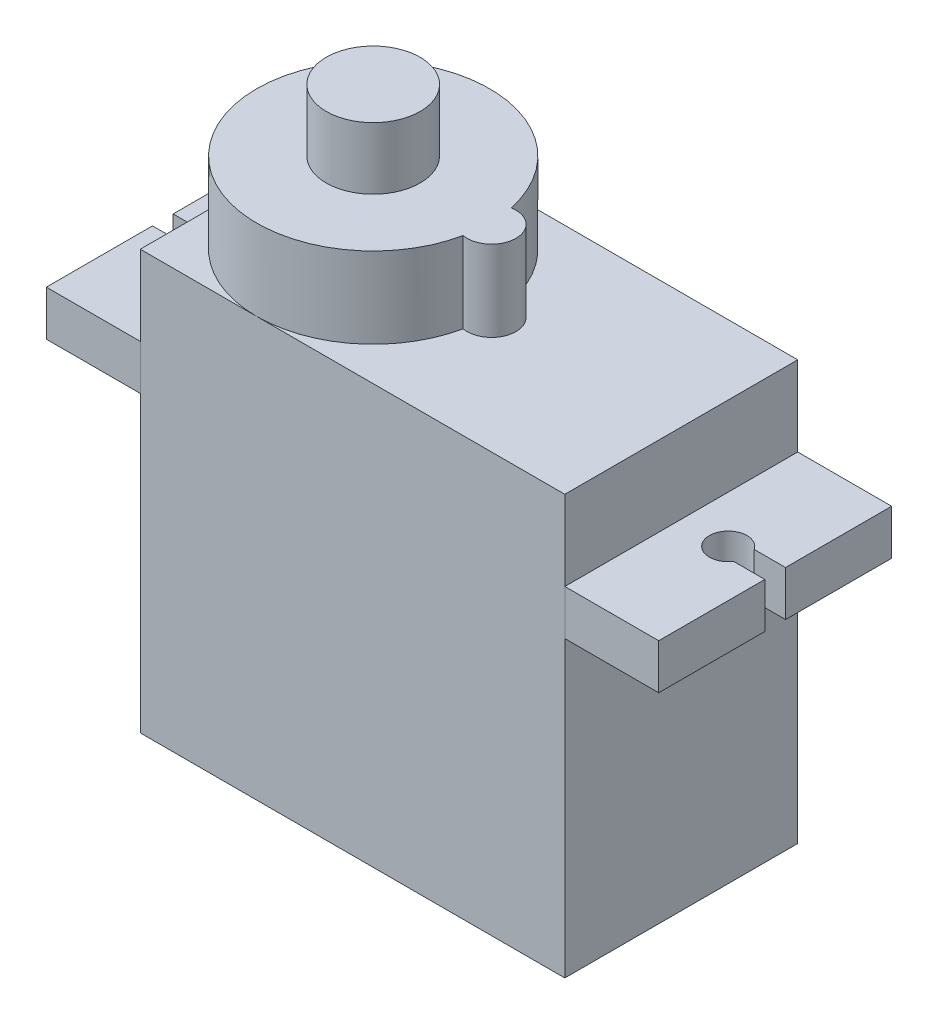
ISO-10303-21;
HEADER;
FILE_DESCRIPTION(('STEP AP214'),'2;1');
FILE_NAME('part.step','',(''),(''),'','','');
FILE_SCHEMA(('AUTOMOTIVE_DESIGN { 1 0 10303 214 1 1 1 1 }'));
ENDSEC;
DATA;
#1=APPLICATION_CONTEXT('core data for automotive mechanical design processes');
#2=APPLICATION_PROTOCOL_DEFINITION('international standard','automotive_design',2000,#1);
#3=PRODUCT_CONTEXT('',#1,'mechanical');
#4=PRODUCT('Part','Part','',(#3));
#5=PRODUCT_RELATED_PRODUCT_CATEGORY('part','',(#4));
#6=PRODUCT_DEFINITION_FORMATION('','',#4);
#7=PRODUCT_DEFINITION_CONTEXT('part definition',#1,'design');
#8=PRODUCT_DEFINITION('design','',#6,#7);
#9=PRODUCT_DEFINITION_SHAPE('','',#8);
#10=(LENGTH_UNIT() NAMED_UNIT(*) SI_UNIT(.MILLI.,.METRE.));
#11=(NAMED_UNIT(*) PLANE_ANGLE_UNIT() SI_UNIT($,.RADIAN.));
#12=(NAMED_UNIT(*) SI_UNIT($,.STERADIAN.) SOLID_ANGLE_UNIT());
#13=UNCERTAINTY_MEASURE_WITH_UNIT(LENGTH_MEASURE(1.E-05),#10,'distance_accuracy_value','');
#14=(GEOMETRIC_REPRESENTATION_CONTEXT(3) GLOBAL_UNCERTAINTY_ASSIGNED_CONTEXT((#13)) GLOBAL_UNIT_ASSIGNED_CONTEXT((#10,
#11,#12)) REPRESENTATION_CONTEXT('',''));
#15=CARTESIAN_POINT('',(0.,0.,0.));
#16=DIRECTION('',(0.,0.,1.));
#17=DIRECTION('',(1.,0.,0.));
#18=AXIS2_PLACEMENT_3D('',#15,#16,#17);
#19=CARTESIAN_POINT('',(-13.6,4.5,1.2));
#20=DIRECTION('',(1.,0.,0.));
#21=DIRECTION('',(0.,0.,-1.));
#22=AXIS2_PLACEMENT_3D('',#19,#20,#21);
#23=CYLINDRICAL_SURFACE('',#22,0.6);
#24=CARTESIAN_POINT('',(-13.6,4.5,1.2));
#25=DIRECTION('',(-1.,0.,0.));
#26=DIRECTION('',(0.,0.,1.));
#27=AXIS2_PLACEMENT_3D('',#24,#25,#26);
#28=CIRCLE('',#27,0.6);
#29=CARTESIAN_POINT('',(-13.6,4.5,1.8));
#30=VERTEX_POINT('',#29);
#31=EDGE_CURVE('E12',#30,#30,#28,.T.);
#32=ORIENTED_EDGE('',*,*,#31,.F.);
#33=EDGE_LOOP('',(#32));
#34=FACE_BOUND('',#33,.T.);
#35=CARTESIAN_POINT('',(-11.3,4.5,1.2));
#36=DIRECTION('',(-1.,0.,0.));
#37=DIRECTION('',(0.,0.,1.));
#38=AXIS2_PLACEMENT_3D('',#35,#36,#37);
#39=CIRCLE('',#38,0.6);
#40=CARTESIAN_POINT('',(-11.3,4.5,1.8));
#41=VERTEX_POINT('',#40);
#42=EDGE_CURVE('E50',#41,#41,#39,.T.);
#43=ORIENTED_EDGE('',*,*,#42,.T.);
#44=EDGE_LOOP('',(#43));
#45=FACE_BOUND('',#44,.T.);
#46=ADVANCED_FACE('F47',(#34,#45),#23,.T.);
#47=CARTESIAN_POINT('',(-13.6,0.,0.));
#48=DIRECTION('',(-1.,0.,0.));
#49=DIRECTION('',(0.,0.,1.));
#50=AXIS2_PLACEMENT_3D('',#47,#48,#49);
#51=PLANE('',#50);
#52=ORIENTED_EDGE('',*,*,#31,.T.);
#53=EDGE_LOOP('',(#52));
#54=FACE_BOUND('',#53,.T.);
#55=ADVANCED_FACE('F62',(#54),#51,.T.);
#56=CARTESIAN_POINT('',(-11.3,0.,0.));
#57=DIRECTION('',(-1.,0.,0.));
#58=DIRECTION('',(0.,0.,1.));
#59=AXIS2_PLACEMENT_3D('',#56,#57,#58);
#60=PLANE('',#59);
#61=ORIENTED_EDGE('',*,*,#42,.F.);
#62=EDGE_LOOP('',(#61));
#63=FACE_BOUND('',#62,.T.);
#64=ADVANCED_FACE('F60',(#63),#60,.F.);
#65=CLOSED_SHELL('',(#46,#55,#64));
#66=MANIFOLD_SOLID_BREP('B2',#65);
#67=CARTESIAN_POINT('',(-13.6,4.5,-1.2));
#68=DIRECTION('',(1.,0.,0.));
#69=DIRECTION('',(0.,0.,-1.));
#70=AXIS2_PLACEMENT_3D('',#67,#68,#69);
#71=CYLINDRICAL_SURFACE('',#70,0.6);
#72=CARTESIAN_POINT('',(-13.6,4.5,-1.2));
#73=DIRECTION('',(-1.,0.,0.));
#74=DIRECTION('',(0.,0.,1.));
#75=AXIS2_PLACEMENT_3D('',#72,#73,#74);
#76=CIRCLE('',#75,0.6);
#77=CARTESIAN_POINT('',(-13.6,4.5,-0.600000000000001));
#78=VERTEX_POINT('',#77);
#79=EDGE_CURVE('E46',#78,#78,#76,.T.);
#80=ORIENTED_EDGE('',*,*,#79,.F.);
#81=EDGE_LOOP('',(#80));
#82=FACE_BOUND('',#81,.T.);
#83=CARTESIAN_POINT('',(-11.3,4.5,-1.2));
#84=DIRECTION('',(-1.,0.,0.));
#85=DIRECTION('',(0.,0.,1.));
#86=AXIS2_PLACEMENT_3D('',#83,#84,#85);
#87=CIRCLE('',#86,0.6);
#88=CARTESIAN_POINT('',(-11.3,4.5,-0.600000000000001));
#89=VERTEX_POINT('',#88);
#90=EDGE_CURVE('E102',#89,#89,#87,.T.);
#91=ORIENTED_EDGE('',*,*,#90,.T.);
#92=EDGE_LOOP('',(#91));
#93=FACE_BOUND('',#92,.T.);
#94=ADVANCED_FACE('F99',(#82,#93),#71,.T.);
#95=CARTESIAN_POINT('',(-13.6,0.,0.));
#96=DIRECTION('',(-1.,0.,0.));
#97=DIRECTION('',(0.,0.,1.));
#98=AXIS2_PLACEMENT_3D('',#95,#96,#97);
#99=PLANE('',#98);
#100=ORIENTED_EDGE('',*,*,#79,.T.);
#101=EDGE_LOOP('',(#100));
#102=FACE_BOUND('',#101,.T.);
#103=ADVANCED_FACE('F114',(#102),#99,.T.);
#104=CARTESIAN_POINT('',(-11.3,0.,0.));
#105=DIRECTION('',(-1.,0.,0.));
#106=DIRECTION('',(0.,0.,1.));
#107=AXIS2_PLACEMENT_3D('',#104,#105,#106);
#108=PLANE('',#107);
#109=ORIENTED_EDGE('',*,*,#90,.F.);
#110=EDGE_LOOP('',(#109));
#111=FACE_BOUND('',#110,.T.);
#112=ADVANCED_FACE('F112',(#111),#108,.F.);
#113=CLOSED_SHELL('',(#94,#103,#112));
#114=MANIFOLD_SOLID_BREP('B7',#113);
#115=CARTESIAN_POINT('',(-13.6,4.5,0.));
#116=DIRECTION('',(1.,0.,0.));
#117=DIRECTION('',(0.,0.,-1.));
#118=AXIS2_PLACEMENT_3D('',#115,#116,#117);
#119=CYLINDRICAL_SURFACE('',#118,0.6);
#120=CARTESIAN_POINT('',(-13.6,4.5,0.));
#121=DIRECTION('',(-1.,0.,0.));
#122=DIRECTION('',(0.,0.,1.));
#123=AXIS2_PLACEMENT_3D('',#120,#121,#122);
#124=CIRCLE('',#123,0.6);
#125=CARTESIAN_POINT('',(-13.6,4.5,0.599999999999999));
#126=VERTEX_POINT('',#125);
#127=EDGE_CURVE('E98',#126,#126,#124,.T.);
#128=ORIENTED_EDGE('',*,*,#127,.F.);
#129=EDGE_LOOP('',(#128));
#130=FACE_BOUND('',#129,.T.);
#131=CARTESIAN_POINT('',(-11.3,4.5,0.));
#132=DIRECTION('',(-1.,0.,0.));
#133=DIRECTION('',(0.,0.,1.));
#134=AXIS2_PLACEMENT_3D('',#131,#132,#133);
#135=CIRCLE('',#134,0.6);
#136=CARTESIAN_POINT('',(-11.3,4.5,0.599999999999999));
#137=VERTEX_POINT('',#136);
#138=EDGE_CURVE('E156',#137,#137,#135,.T.);
#139=ORIENTED_EDGE('',*,*,#138,.T.);
#140=EDGE_LOOP('',(#139));
#141=FACE_BOUND('',#140,.T.);
#142=ADVANCED_FACE('F153',(#130,#141),#119,.T.);
#143=CARTESIAN_POINT('',(-13.6,0.,0.));
#144=DIRECTION('',(-1.,0.,0.));
#145=DIRECTION('',(0.,0.,1.));
#146=AXIS2_PLACEMENT_3D('',#143,#144,#145);
#147=PLANE('',#146);
#148=ORIENTED_EDGE('',*,*,#127,.T.);
#149=EDGE_LOOP('',(#148));
#150=FACE_BOUND('',#149,.T.);
#151=ADVANCED_FACE('F168',(#150),#147,.T.);
#152=CARTESIAN_POINT('',(-11.3,0.,0.));
#153=DIRECTION('',(-1.,0.,0.));
#154=DIRECTION('',(0.,0.,1.));
#155=AXIS2_PLACEMENT_3D('',#152,#153,#154);
#156=PLANE('',#155);
#157=ORIENTED_EDGE('',*,*,#138,.F.);
#158=EDGE_LOOP('',(#157));
#159=FACE_BOUND('',#158,.T.);
#160=ADVANCED_FACE('F166',(#159),#156,.F.);
#161=CLOSED_SHELL('',(#142,#151,#160));
#162=MANIFOLD_SOLID_BREP('B41',#161);
#163=CARTESIAN_POINT('',(-16.3,0.,0.));
#164=DIRECTION('',(-1.,0.,0.));
#165=DIRECTION('',(0.,0.,1.));
#166=AXIS2_PLACEMENT_3D('',#163,#164,#165);
#167=PLANE('',#166);
#168=DIRECTION('',(0.,1.,0.));
#169=VECTOR('',#168,1.);
#170=CARTESIAN_POINT('',(-16.3,-0.001000000000001,-0.55));
#171=LINE('',#170,#169);
#172=CARTESIAN_POINT('',(-16.3,15.65,-0.55));
#173=VERTEX_POINT('',#172);
#174=CARTESIAN_POINT('',(-16.3,18.05,-0.55));
#175=VERTEX_POINT('',#174);
#176=EDGE_CURVE('E337',#173,#175,#171,.T.);
#177=ORIENTED_EDGE('',*,*,#176,.T.);
#178=DIRECTION('',(0.,0.,-1.));
#179=VECTOR('',#178,1.);
#180=CARTESIAN_POINT('',(-16.3,18.05,6.2));
#181=LINE('',#180,#179);
#182=CARTESIAN_POINT('',(-16.3,18.05,-6.2));
#183=VERTEX_POINT('',#182);
#184=EDGE_CURVE('E260',#175,#183,#181,.T.);
#185=ORIENTED_EDGE('',*,*,#184,.T.);
#186=DIRECTION('',(0.,-1.,0.));
#187=VECTOR('',#186,1.);
#188=CARTESIAN_POINT('',(-16.3,18.05,-6.2));
#189=LINE('',#188,#187);
#190=CARTESIAN_POINT('',(-16.3,15.65,-6.2));
#191=VERTEX_POINT('',#190);
#192=EDGE_CURVE('E299',#183,#191,#189,.T.);
#193=ORIENTED_EDGE('',*,*,#192,.T.);
#194=DIRECTION('',(0.,0.,1.));
#195=VECTOR('',#194,1.);
#196=CARTESIAN_POINT('',(-16.3,15.65,-6.2));
#197=LINE('',#196,#195);
#198=EDGE_CURVE('E305',#191,#173,#197,.T.);
#199=ORIENTED_EDGE('',*,*,#198,.T.);
#200=EDGE_LOOP('',(#177,#185,#193,#199));
#201=FACE_BOUND('',#200,.T.);
#202=ADVANCED_FACE('F207',(#201),#167,.T.);
#203=CARTESIAN_POINT('',(-16.3,18.05,6.2));
#204=DIRECTION('',(0.,-1.,0.));
#205=DIRECTION('',(0.,0.,-1.));
#206=AXIS2_PLACEMENT_3D('',#203,#204,#205);
#207=PLANE('',#206);
#208=ORIENTED_EDGE('',*,*,#184,.F.);
#209=DIRECTION('',(-1.,0.,0.));
#210=VECTOR('',#209,1.);
#211=CARTESIAN_POINT('',(-16.3,18.05,-0.55));
#212=LINE('',#211,#210);
#213=CARTESIAN_POINT('',(-14.6351646544245,18.05,-0.55));
#214=VERTEX_POINT('',#213);
#215=EDGE_CURVE('E288',#214,#175,#212,.T.);
#216=ORIENTED_EDGE('',*,*,#215,.F.);
#217=CARTESIAN_POINT('',(-13.8,18.05,0.));
#218=DIRECTION('',(0.,1.,0.));
#219=DIRECTION('',(0.,0.,1.));
#220=AXIS2_PLACEMENT_3D('',#217,#218,#219);
#221=CIRCLE('',#220,1.);
#222=CARTESIAN_POINT('',(-14.6351646544245,18.05,0.55));
#223=VERTEX_POINT('',#222);
#224=EDGE_CURVE('E295',#223,#214,#221,.T.);
#225=ORIENTED_EDGE('',*,*,#224,.F.);
#226=DIRECTION('',(1.,0.,0.));
#227=VECTOR('',#226,1.);
#228=CARTESIAN_POINT('',(-16.3,18.05,0.55));
#229=LINE('',#228,#227);
#230=CARTESIAN_POINT('',(-16.3,18.05,0.55));
#231=VERTEX_POINT('',#230);
#232=EDGE_CURVE('E284',#231,#223,#229,.T.);
#233=ORIENTED_EDGE('',*,*,#232,.F.);
#234=CARTESIAN_POINT('',(-16.3,18.05,6.2));
#235=VERTEX_POINT('',#234);
#236=EDGE_CURVE('E292',#235,#231,#181,.T.);
#237=ORIENTED_EDGE('',*,*,#236,.F.);
#238=DIRECTION('',(1.,0.,0.));
#239=VECTOR('',#238,1.);
#240=CARTESIAN_POINT('',(-16.3,18.05,6.2));
#241=LINE('',#240,#239);
#242=CARTESIAN_POINT('',(-11.3,18.05,6.2));
#243=VERTEX_POINT('',#242);
#244=EDGE_CURVE('E309',#235,#243,#241,.T.);
#245=ORIENTED_EDGE('',*,*,#244,.T.);
#246=DIRECTION('',(0.,0.,-1.));
#247=VECTOR('',#246,1.);
#248=CARTESIAN_POINT('',(-11.3,18.05,6.2));
#249=LINE('',#248,#247);
#250=CARTESIAN_POINT('',(-11.3,18.05,-6.2));
#251=VERTEX_POINT('',#250);
#252=EDGE_CURVE('E310',#243,#251,#249,.T.);
#253=ORIENTED_EDGE('',*,*,#252,.T.);
#254=DIRECTION('',(1.,0.,0.));
#255=VECTOR('',#254,1.);
#256=CARTESIAN_POINT('',(-16.3,18.05,-6.2));
#257=LINE('',#256,#255);
#258=EDGE_CURVE('E151',#183,#251,#257,.T.);
#259=ORIENTED_EDGE('',*,*,#258,.F.);
#260=EDGE_LOOP('',(#208,#216,#225,#233,#237,#245,#253,#259));
#261=FACE_BOUND('',#260,.T.);
#262=ADVANCED_FACE('F209',(#261),#207,.F.);
#263=CARTESIAN_POINT('',(-16.3,18.05,-6.2));
#264=DIRECTION('',(0.,0.,1.));
#265=DIRECTION('',(1.,0.,0.));
#266=AXIS2_PLACEMENT_3D('',#263,#264,#265);
#267=PLANE('',#266);
#268=DIRECTION('',(0.,-1.,0.));
#269=VECTOR('',#268,1.);
#270=CARTESIAN_POINT('',(-11.3,18.05,-6.2));
#271=LINE('',#270,#269);
#272=CARTESIAN_POINT('',(-11.3,15.65,-6.2));
#273=VERTEX_POINT('',#272);
#274=EDGE_CURVE('E313',#251,#273,#271,.T.);
#275=ORIENTED_EDGE('',*,*,#274,.T.);
#276=DIRECTION('',(1.,0.,0.));
#277=VECTOR('',#276,1.);
#278=CARTESIAN_POINT('',(-16.3,15.65,-6.2));
#279=LINE('',#278,#277);
#280=EDGE_CURVE('E215',#191,#273,#279,.T.);
#281=ORIENTED_EDGE('',*,*,#280,.F.);
#282=ORIENTED_EDGE('',*,*,#192,.F.);
#283=ORIENTED_EDGE('',*,*,#258,.T.);
#284=EDGE_LOOP('',(#275,#281,#282,#283));
#285=FACE_BOUND('',#284,.T.);
#286=ADVANCED_FACE('F351',(#285),#267,.F.);
#287=CARTESIAN_POINT('',(-16.3,15.65,-6.2));
#288=DIRECTION('',(0.,1.,0.));
#289=DIRECTION('',(0.,0.,1.));
#290=AXIS2_PLACEMENT_3D('',#287,#288,#289);
#291=PLANE('',#290);
#292=CARTESIAN_POINT('',(-13.8,15.65,0.));
#293=DIRECTION('',(0.,1.,0.));
#294=DIRECTION('',(0.,0.,1.));
#295=AXIS2_PLACEMENT_3D('',#292,#293,#294);
#296=CIRCLE('',#295,1.);
#297=CARTESIAN_POINT('',(-14.6351646544245,15.65,-0.55));
#298=VERTEX_POINT('',#297);
#299=CARTESIAN_POINT('',(-14.6351646544245,15.65,0.55));
#300=VERTEX_POINT('',#299);
#301=EDGE_CURVE('E336',#298,#300,#296,.F.);
#302=ORIENTED_EDGE('',*,*,#301,.F.);
#303=DIRECTION('',(1.,0.,0.));
#304=VECTOR('',#303,1.);
#305=CARTESIAN_POINT('',(-16.3,15.65,-0.55));
#306=LINE('',#305,#304);
#307=EDGE_CURVE('E296',#173,#298,#306,.T.);
#308=ORIENTED_EDGE('',*,*,#307,.F.);
#309=ORIENTED_EDGE('',*,*,#198,.F.);
#310=ORIENTED_EDGE('',*,*,#280,.T.);
#311=DIRECTION('',(0.,0.,1.));
#312=VECTOR('',#311,1.);
#313=CARTESIAN_POINT('',(-11.3,15.65,-6.2));
#314=LINE('',#313,#312);
#315=CARTESIAN_POINT('',(-11.3,15.65,6.2));
#316=VERTEX_POINT('',#315);
#317=EDGE_CURVE('E315',#273,#316,#314,.T.);
#318=ORIENTED_EDGE('',*,*,#317,.T.);
#319=DIRECTION('',(1.,0.,0.));
#320=VECTOR('',#319,1.);
#321=CARTESIAN_POINT('',(-16.3,15.65,6.2));
#322=LINE('',#321,#320);
#323=CARTESIAN_POINT('',(-16.3,15.65,6.2));
#324=VERTEX_POINT('',#323);
#325=EDGE_CURVE('E319',#324,#316,#322,.T.);
#326=ORIENTED_EDGE('',*,*,#325,.F.);
#327=CARTESIAN_POINT('',(-16.3,15.65,0.549999999999997));
#328=VERTEX_POINT('',#327);
#329=EDGE_CURVE('E301',#328,#324,#197,.T.);
#330=ORIENTED_EDGE('',*,*,#329,.F.);
#331=DIRECTION('',(-1.,0.,0.));
#332=VECTOR('',#331,1.);
#333=CARTESIAN_POINT('',(-16.3,15.65,0.55));
#334=LINE('',#333,#332);
#335=EDGE_CURVE('E222',#300,#328,#334,.T.);
#336=ORIENTED_EDGE('',*,*,#335,.F.);
#337=EDGE_LOOP('',(#302,#308,#309,#310,#318,#326,#330,#336));
#338=FACE_BOUND('',#337,.T.);
#339=ADVANCED_FACE('F326',(#338),#291,.F.);
#340=CARTESIAN_POINT('',(-16.3,15.65,6.2));
#341=DIRECTION('',(0.,0.,-1.));
#342=DIRECTION('',(-1.,0.,0.));
#343=AXIS2_PLACEMENT_3D('',#340,#341,#342);
#344=PLANE('',#343);
#345=DIRECTION('',(0.,1.,0.));
#346=VECTOR('',#345,1.);
#347=CARTESIAN_POINT('',(-11.3,15.65,6.2));
#348=LINE('',#347,#346);
#349=EDGE_CURVE('E252',#316,#243,#348,.T.);
#350=ORIENTED_EDGE('',*,*,#349,.T.);
#351=ORIENTED_EDGE('',*,*,#244,.F.);
#352=DIRECTION('',(0.,1.,0.));
#353=VECTOR('',#352,1.);
#354=CARTESIAN_POINT('',(-16.3,15.65,6.2));
#355=LINE('',#354,#353);
#356=EDGE_CURVE('E231',#324,#235,#355,.T.);
#357=ORIENTED_EDGE('',*,*,#356,.F.);
#358=ORIENTED_EDGE('',*,*,#325,.T.);
#359=EDGE_LOOP('',(#350,#351,#357,#358));
#360=FACE_BOUND('',#359,.T.);
#361=ADVANCED_FACE('F334',(#360),#344,.F.);
#362=DIRECTION('',(0.,1.,0.));
#363=VECTOR('',#362,1.);
#364=CARTESIAN_POINT('',(-16.3,-0.001000000000001,0.55));
#365=LINE('',#364,#363);
#366=EDGE_CURVE('E281',#328,#231,#365,.T.);
#367=ORIENTED_EDGE('',*,*,#366,.F.);
#368=ORIENTED_EDGE('',*,*,#329,.T.);
#369=ORIENTED_EDGE('',*,*,#356,.T.);
#370=ORIENTED_EDGE('',*,*,#236,.T.);
#371=EDGE_LOOP('',(#367,#368,#369,#370));
#372=FACE_BOUND('',#371,.T.);
#373=ADVANCED_FACE('F298',(#372),#167,.T.);
#374=CARTESIAN_POINT('',(-11.3,0.,0.));
#375=DIRECTION('',(-1.,0.,0.));
#376=DIRECTION('',(0.,0.,1.));
#377=AXIS2_PLACEMENT_3D('',#374,#375,#376);
#378=PLANE('',#377);
#379=ORIENTED_EDGE('',*,*,#252,.F.);
#380=ORIENTED_EDGE('',*,*,#349,.F.);
#381=ORIENTED_EDGE('',*,*,#317,.F.);
#382=ORIENTED_EDGE('',*,*,#274,.F.);
#383=EDGE_LOOP('',(#379,#380,#381,#382));
#384=FACE_BOUND('',#383,.T.);
#385=ADVANCED_FACE('F332',(#384),#378,.F.);
#386=CARTESIAN_POINT('',(-16.3,-0.001000000000001,-0.55));
#387=DIRECTION('',(0.,0.,-1.));
#388=DIRECTION('',(-1.,0.,0.));
#389=AXIS2_PLACEMENT_3D('',#386,#387,#388);
#390=PLANE('',#389);
#391=ORIENTED_EDGE('',*,*,#307,.T.);
#392=DIRECTION('',(0.,1.,0.));
#393=VECTOR('',#392,1.);
#394=CARTESIAN_POINT('',(-14.6351646544245,-0.001000000000001,-0.55));
#395=LINE('',#394,#393);
#396=EDGE_CURVE('E338',#298,#214,#395,.T.);
#397=ORIENTED_EDGE('',*,*,#396,.T.);
#398=ORIENTED_EDGE('',*,*,#215,.T.);
#399=ORIENTED_EDGE('',*,*,#176,.F.);
#400=EDGE_LOOP('',(#391,#397,#398,#399));
#401=FACE_BOUND('',#400,.T.);
#402=ADVANCED_FACE('F350',(#401),#390,.F.);
#403=CARTESIAN_POINT('',(-13.8,-0.001000000000001,0.));
#404=DIRECTION('',(0.,1.,0.));
#405=DIRECTION('',(0.,0.,1.));
#406=AXIS2_PLACEMENT_3D('',#403,#404,#405);
#407=CYLINDRICAL_SURFACE('',#406,1.);
#408=ORIENTED_EDGE('',*,*,#301,.T.);
#409=DIRECTION('',(0.,1.,0.));
#410=VECTOR('',#409,1.);
#411=CARTESIAN_POINT('',(-14.6351646544245,-0.001000000000001,0.55));
#412=LINE('',#411,#410);
#413=EDGE_CURVE('E287',#300,#223,#412,.T.);
#414=ORIENTED_EDGE('',*,*,#413,.T.);
#415=ORIENTED_EDGE('',*,*,#224,.T.);
#416=ORIENTED_EDGE('',*,*,#396,.F.);
#417=EDGE_LOOP('',(#408,#414,#415,#416));
#418=FACE_BOUND('',#417,.T.);
#419=ADVANCED_FACE('F345',(#418),#407,.F.);
#420=CARTESIAN_POINT('',(-16.3,-0.001000000000001,0.55));
#421=DIRECTION('',(0.,0.,1.));
#422=DIRECTION('',(1.,0.,0.));
#423=AXIS2_PLACEMENT_3D('',#420,#421,#422);
#424=PLANE('',#423);
#425=ORIENTED_EDGE('',*,*,#335,.T.);
#426=ORIENTED_EDGE('',*,*,#366,.T.);
#427=ORIENTED_EDGE('',*,*,#232,.T.);
#428=ORIENTED_EDGE('',*,*,#413,.F.);
#429=EDGE_LOOP('',(#425,#426,#427,#428));
#430=FACE_BOUND('',#429,.T.);
#431=ADVANCED_FACE('F283',(#430),#424,.F.);
#432=CLOSED_SHELL('',(#202,#262,#286,#339,#361,#373,#385,#402,#419,#431));
#433=MANIFOLD_SOLID_BREP('B93',#432);
#434=CARTESIAN_POINT('',(16.3,15.65,6.2));
#435=DIRECTION('',(0.,1.,0.));
#436=DIRECTION('',(0.,0.,1.));
#437=AXIS2_PLACEMENT_3D('',#434,#435,#436);
#438=PLANE('',#437);
#439=DIRECTION('',(-1.,0.,0.));
#440=VECTOR('',#439,1.);
#441=CARTESIAN_POINT('',(14.6351646544245,15.65,-0.55));
#442=LINE('',#441,#440);
#443=CARTESIAN_POINT('',(16.3,15.65,-0.55));
#444=VERTEX_POINT('',#443);
#445=CARTESIAN_POINT('',(14.6351646544245,15.65,-0.55));
#446=VERTEX_POINT('',#445);
#447=EDGE_CURVE('E532',#444,#446,#442,.T.);
#448=ORIENTED_EDGE('',*,*,#447,.T.);
#449=CARTESIAN_POINT('',(13.8,15.65,0.));
#450=DIRECTION('',(0.,1.,0.));
#451=DIRECTION('',(0.,0.,1.));
#452=AXIS2_PLACEMENT_3D('',#449,#450,#451);
#453=CIRCLE('',#452,1.);
#454=CARTESIAN_POINT('',(14.6351646544245,15.65,0.55));
#455=VERTEX_POINT('',#454);
#456=EDGE_CURVE('E519',#455,#446,#453,.F.);
#457=ORIENTED_EDGE('',*,*,#456,.F.);
#458=DIRECTION('',(-1.,0.,0.));
#459=VECTOR('',#458,1.);
#460=CARTESIAN_POINT('',(14.6351646544245,15.65,0.55));
#461=LINE('',#460,#459);
#462=CARTESIAN_POINT('',(16.3,15.65,0.55));
#463=VERTEX_POINT('',#462);
#464=EDGE_CURVE('E526',#463,#455,#461,.T.);
#465=ORIENTED_EDGE('',*,*,#464,.F.);
#466=DIRECTION('',(0.,0.,-1.));
#467=VECTOR('',#466,1.);
#468=CARTESIAN_POINT('',(16.3,15.65,6.2));
#469=LINE('',#468,#467);
#470=CARTESIAN_POINT('',(16.3,15.65,6.2));
#471=VERTEX_POINT('',#470);
#472=EDGE_CURVE('E492',#471,#463,#469,.T.);
#473=ORIENTED_EDGE('',*,*,#472,.F.);
#474=DIRECTION('',(-1.,0.,0.));
#475=VECTOR('',#474,1.);
#476=CARTESIAN_POINT('',(16.3,15.65,6.2));
#477=LINE('',#476,#475);
#478=CARTESIAN_POINT('',(11.3,15.65,6.2));
#479=VERTEX_POINT('',#478);
#480=EDGE_CURVE('E205',#471,#479,#477,.T.);
#481=ORIENTED_EDGE('',*,*,#480,.T.);
#482=DIRECTION('',(0.,0.,-1.));
#483=VECTOR('',#482,1.);
#484=CARTESIAN_POINT('',(11.3,15.65,6.2));
#485=LINE('',#484,#483);
#486=CARTESIAN_POINT('',(11.3,15.65,-6.2));
#487=VERTEX_POINT('',#486);
#488=EDGE_CURVE('E556',#479,#487,#485,.T.);
#489=ORIENTED_EDGE('',*,*,#488,.T.);
#490=DIRECTION('',(-1.,0.,0.));
#491=VECTOR('',#490,1.);
#492=CARTESIAN_POINT('',(16.3,15.65,-6.2));
#493=LINE('',#492,#491);
#494=CARTESIAN_POINT('',(16.3,15.65,-6.2));
#495=VERTEX_POINT('',#494);
#496=EDGE_CURVE('E448',#495,#487,#493,.T.);
#497=ORIENTED_EDGE('',*,*,#496,.F.);
#498=EDGE_CURVE('E546',#444,#495,#469,.T.);
#499=ORIENTED_EDGE('',*,*,#498,.F.);
#500=EDGE_LOOP('',(#448,#457,#465,#473,#481,#489,#497,#499));
#501=FACE_BOUND('',#500,.T.);
#502=ADVANCED_FACE('F440',(#501),#438,.F.);
#503=CARTESIAN_POINT('',(16.3,18.05,6.2));
#504=DIRECTION('',(0.,-1.,0.));
#505=DIRECTION('',(0.,0.,-1.));
#506=AXIS2_PLACEMENT_3D('',#503,#504,#505);
#507=PLANE('',#506);
#508=DIRECTION('',(1.,0.,0.));
#509=VECTOR('',#508,1.);
#510=CARTESIAN_POINT('',(14.6351646544245,18.05,-0.55));
#511=LINE('',#510,#509);
#512=CARTESIAN_POINT('',(14.6351646544245,18.05,-0.55));
#513=VERTEX_POINT('',#512);
#514=CARTESIAN_POINT('',(16.3,18.05,-0.55));
#515=VERTEX_POINT('',#514);
#516=EDGE_CURVE('E524',#513,#515,#511,.T.);
#517=ORIENTED_EDGE('',*,*,#516,.T.);
#518=DIRECTION('',(0.,0.,1.));
#519=VECTOR('',#518,1.);
#520=CARTESIAN_POINT('',(16.3,18.05,6.2));
#521=LINE('',#520,#519);
#522=CARTESIAN_POINT('',(16.3,18.05,-6.2));
#523=VERTEX_POINT('',#522);
#524=EDGE_CURVE('E550',#523,#515,#521,.T.);
#525=ORIENTED_EDGE('',*,*,#524,.F.);
#526=DIRECTION('',(-1.,0.,0.));
#527=VECTOR('',#526,1.);
#528=CARTESIAN_POINT('',(16.3,18.05,-6.2));
#529=LINE('',#528,#527);
#530=CARTESIAN_POINT('',(11.3,18.05,-6.2));
#531=VERTEX_POINT('',#530);
#532=EDGE_CURVE('E562',#523,#531,#529,.T.);
#533=ORIENTED_EDGE('',*,*,#532,.T.);
#534=DIRECTION('',(0.,0.,1.));
#535=VECTOR('',#534,1.);
#536=CARTESIAN_POINT('',(11.3,18.05,6.2));
#537=LINE('',#536,#535);
#538=CARTESIAN_POINT('',(11.3,18.05,6.2));
#539=VERTEX_POINT('',#538);
#540=EDGE_CURVE('E485',#531,#539,#537,.T.);
#541=ORIENTED_EDGE('',*,*,#540,.T.);
#542=DIRECTION('',(-1.,0.,0.));
#543=VECTOR('',#542,1.);
#544=CARTESIAN_POINT('',(16.3,18.05,6.2));
#545=LINE('',#544,#543);
#546=CARTESIAN_POINT('',(16.3,18.05,6.2));
#547=VERTEX_POINT('',#546);
#548=EDGE_CURVE('E553',#547,#539,#545,.T.);
#549=ORIENTED_EDGE('',*,*,#548,.F.);
#550=CARTESIAN_POINT('',(16.3,18.05,0.550000000000002));
#551=VERTEX_POINT('',#550);
#552=EDGE_CURVE('E463',#551,#547,#521,.T.);
#553=ORIENTED_EDGE('',*,*,#552,.F.);
#554=DIRECTION('',(1.,0.,0.));
#555=VECTOR('',#554,1.);
#556=CARTESIAN_POINT('',(14.6351646544245,18.05,0.55));
#557=LINE('',#556,#555);
#558=CARTESIAN_POINT('',(14.6351646544245,18.05,0.55));
#559=VERTEX_POINT('',#558);
#560=EDGE_CURVE('E455',#559,#551,#557,.T.);
#561=ORIENTED_EDGE('',*,*,#560,.F.);
#562=CARTESIAN_POINT('',(13.8,18.05,0.));
#563=DIRECTION('',(0.,1.,0.));
#564=DIRECTION('',(0.,0.,1.));
#565=AXIS2_PLACEMENT_3D('',#562,#563,#564);
#566=CIRCLE('',#565,1.);
#567=EDGE_CURVE('E522',#513,#559,#566,.T.);
#568=ORIENTED_EDGE('',*,*,#567,.F.);
#569=EDGE_LOOP('',(#517,#525,#533,#541,#549,#553,#561,#568));
#570=FACE_BOUND('',#569,.T.);
#571=ADVANCED_FACE('F576',(#570),#507,.F.);
#572=CARTESIAN_POINT('',(16.3,0.,0.));
#573=DIRECTION('',(1.,0.,0.));
#574=DIRECTION('',(0.,0.,-1.));
#575=AXIS2_PLACEMENT_3D('',#572,#573,#574);
#576=PLANE('',#575);
#577=ORIENTED_EDGE('',*,*,#524,.T.);
#578=DIRECTION('',(0.,1.,0.));
#579=VECTOR('',#578,1.);
#580=CARTESIAN_POINT('',(16.3,-0.001000000000001,-0.55));
#581=LINE('',#580,#579);
#582=EDGE_CURVE('E541',#444,#515,#581,.T.);
#583=ORIENTED_EDGE('',*,*,#582,.F.);
#584=ORIENTED_EDGE('',*,*,#498,.T.);
#585=DIRECTION('',(0.,1.,0.));
#586=VECTOR('',#585,1.);
#587=CARTESIAN_POINT('',(16.3,18.05,-6.2));
#588=LINE('',#587,#586);
#589=EDGE_CURVE('E548',#495,#523,#588,.T.);
#590=ORIENTED_EDGE('',*,*,#589,.T.);
#591=EDGE_LOOP('',(#577,#583,#584,#590));
#592=FACE_BOUND('',#591,.T.);
#593=ADVANCED_FACE('F582',(#592),#576,.T.);
#594=CARTESIAN_POINT('',(16.3,18.05,6.2));
#595=DIRECTION('',(0.,0.,-1.));
#596=DIRECTION('',(-1.,0.,0.));
#597=AXIS2_PLACEMENT_3D('',#594,#595,#596);
#598=PLANE('',#597);
#599=DIRECTION('',(0.,-1.,0.));
#600=VECTOR('',#599,1.);
#601=CARTESIAN_POINT('',(11.3,18.05,6.2));
#602=LINE('',#601,#600);
#603=EDGE_CURVE('E528',#539,#479,#602,.T.);
#604=ORIENTED_EDGE('',*,*,#603,.T.);
#605=ORIENTED_EDGE('',*,*,#480,.F.);
#606=DIRECTION('',(0.,-1.,0.));
#607=VECTOR('',#606,1.);
#608=CARTESIAN_POINT('',(16.3,18.05,6.2));
#609=LINE('',#608,#607);
#610=EDGE_CURVE('E544',#547,#471,#609,.T.);
#611=ORIENTED_EDGE('',*,*,#610,.F.);
#612=ORIENTED_EDGE('',*,*,#548,.T.);
#613=EDGE_LOOP('',(#604,#605,#611,#612));
#614=FACE_BOUND('',#613,.T.);
#615=ADVANCED_FACE('F442',(#614),#598,.F.);
#616=CARTESIAN_POINT('',(16.3,18.05,-6.2));
#617=DIRECTION('',(0.,0.,1.));
#618=DIRECTION('',(1.,0.,0.));
#619=AXIS2_PLACEMENT_3D('',#616,#617,#618);
#620=PLANE('',#619);
#621=DIRECTION('',(0.,1.,0.));
#622=VECTOR('',#621,1.);
#623=CARTESIAN_POINT('',(11.3,18.05,-6.2));
#624=LINE('',#623,#622);
#625=EDGE_CURVE('E558',#487,#531,#624,.T.);
#626=ORIENTED_EDGE('',*,*,#625,.T.);
#627=ORIENTED_EDGE('',*,*,#532,.F.);
#628=ORIENTED_EDGE('',*,*,#589,.F.);
#629=ORIENTED_EDGE('',*,*,#496,.T.);
#630=EDGE_LOOP('',(#626,#627,#628,#629));
#631=FACE_BOUND('',#630,.T.);
#632=ADVANCED_FACE('F568',(#631),#620,.F.);
#633=DIRECTION('',(0.,1.,0.));
#634=VECTOR('',#633,1.);
#635=CARTESIAN_POINT('',(16.3,-0.001000000000001,0.55));
#636=LINE('',#635,#634);
#637=EDGE_CURVE('E523',#463,#551,#636,.T.);
#638=ORIENTED_EDGE('',*,*,#637,.T.);
#639=ORIENTED_EDGE('',*,*,#552,.T.);
#640=ORIENTED_EDGE('',*,*,#610,.T.);
#641=ORIENTED_EDGE('',*,*,#472,.T.);
#642=EDGE_LOOP('',(#638,#639,#640,#641));
#643=FACE_BOUND('',#642,.T.);
#644=ADVANCED_FACE('F599',(#643),#576,.T.);
#645=CARTESIAN_POINT('',(11.3,0.,0.));
#646=DIRECTION('',(1.,0.,0.));
#647=DIRECTION('',(0.,0.,-1.));
#648=AXIS2_PLACEMENT_3D('',#645,#646,#647);
#649=PLANE('',#648);
#650=ORIENTED_EDGE('',*,*,#603,.F.);
#651=ORIENTED_EDGE('',*,*,#540,.F.);
#652=ORIENTED_EDGE('',*,*,#625,.F.);
#653=ORIENTED_EDGE('',*,*,#488,.F.);
#654=EDGE_LOOP('',(#650,#651,#652,#653));
#655=FACE_BOUND('',#654,.T.);
#656=ADVANCED_FACE('F572',(#655),#649,.F.);
#657=CARTESIAN_POINT('',(13.8,-0.001000000000001,0.));
#658=DIRECTION('',(0.,1.,0.));
#659=DIRECTION('',(0.,0.,1.));
#660=AXIS2_PLACEMENT_3D('',#657,#658,#659);
#661=CYLINDRICAL_SURFACE('',#660,1.);
#662=ORIENTED_EDGE('',*,*,#456,.T.);
#663=DIRECTION('',(0.,1.,0.));
#664=VECTOR('',#663,1.);
#665=CARTESIAN_POINT('',(14.6351646544245,-0.001000000000001,-0.55));
#666=LINE('',#665,#664);
#667=EDGE_CURVE('E529',#446,#513,#666,.T.);
#668=ORIENTED_EDGE('',*,*,#667,.T.);
#669=ORIENTED_EDGE('',*,*,#567,.T.);
#670=DIRECTION('',(0.,1.,0.));
#671=VECTOR('',#670,1.);
#672=CARTESIAN_POINT('',(14.6351646544245,-0.001000000000001,0.55));
#673=LINE('',#672,#671);
#674=EDGE_CURVE('E515',#455,#559,#673,.T.);
#675=ORIENTED_EDGE('',*,*,#674,.F.);
#676=EDGE_LOOP('',(#662,#668,#669,#675));
#677=FACE_BOUND('',#676,.T.);
#678=ADVANCED_FACE('F517',(#677),#661,.F.);
#679=CARTESIAN_POINT('',(14.6351646544245,-0.001000000000001,-0.55));
#680=DIRECTION('',(0.,0.,1.));
#681=DIRECTION('',(1.,0.,0.));
#682=AXIS2_PLACEMENT_3D('',#679,#680,#681);
#683=PLANE('',#682);
#684=ORIENTED_EDGE('',*,*,#582,.T.);
#685=ORIENTED_EDGE('',*,*,#516,.F.);
#686=ORIENTED_EDGE('',*,*,#667,.F.);
#687=ORIENTED_EDGE('',*,*,#447,.F.);
#688=EDGE_LOOP('',(#684,#685,#686,#687));
#689=FACE_BOUND('',#688,.T.);
#690=ADVANCED_FACE('F583',(#689),#683,.T.);
#691=CARTESIAN_POINT('',(14.6351646544245,-0.001000000000001,0.55));
#692=DIRECTION('',(0.,0.,1.));
#693=DIRECTION('',(1.,0.,0.));
#694=AXIS2_PLACEMENT_3D('',#691,#692,#693);
#695=PLANE('',#694);
#696=ORIENTED_EDGE('',*,*,#464,.T.);
#697=ORIENTED_EDGE('',*,*,#674,.T.);
#698=ORIENTED_EDGE('',*,*,#560,.T.);
#699=ORIENTED_EDGE('',*,*,#637,.F.);
#700=EDGE_LOOP('',(#696,#697,#698,#699));
#701=FACE_BOUND('',#700,.T.);
#702=ADVANCED_FACE('F527',(#701),#695,.F.);
#703=CLOSED_SHELL('',(#502,#571,#593,#615,#632,#644,#656,#678,#690,#702));
#704=MANIFOLD_SOLID_BREP('B145',#703);
#705=CARTESIAN_POINT('',(0.,22.3,0.));
#706=DIRECTION('',(0.,-1.,0.));
#707=DIRECTION('',(0.,0.,-1.));
#708=AXIS2_PLACEMENT_3D('',#705,#706,#707);
#709=PLANE('',#708);
#710=CARTESIAN_POINT('',(1.2,22.3,0.));
#711=DIRECTION('',(0.,1.,0.));
#712=DIRECTION('',(0.,0.,1.));
#713=AXIS2_PLACEMENT_3D('',#710,#711,#712);
#714=CIRCLE('',#713,1.3);
#715=CARTESIAN_POINT('',(0.966666666666667,22.3,1.27888840621673));
#716=VERTEX_POINT('',#715);
#717=CARTESIAN_POINT('',(0.966666666666667,22.3,-1.27888840621673));
#718=VERTEX_POINT('',#717);
#719=EDGE_CURVE('E743',#716,#718,#714,.T.);
#720=ORIENTED_EDGE('',*,*,#719,.F.);
#721=CARTESIAN_POINT('',(-5.1,22.3,0.));
#722=DIRECTION('',(0.,1.,0.));
#723=DIRECTION('',(0.,0.,1.));
#724=AXIS2_PLACEMENT_3D('',#721,#722,#723);
#725=CIRCLE('',#724,6.2);
#726=CARTESIAN_POINT('',(-5.1,22.3,6.2));
#727=VERTEX_POINT('',#726);
#728=EDGE_CURVE('E687',#727,#716,#725,.T.);
#729=ORIENTED_EDGE('',*,*,#728,.F.);
#730=DIRECTION('',(1.,0.,0.));
#731=VECTOR('',#730,1.);
#732=CARTESIAN_POINT('',(-11.3,22.3,6.2));
#733=LINE('',#732,#731);
#734=CARTESIAN_POINT('',(11.3,22.3,6.2));
#735=VERTEX_POINT('',#734);
#736=EDGE_CURVE('E763',#727,#735,#733,.T.);
#737=ORIENTED_EDGE('',*,*,#736,.T.);
#738=DIRECTION('',(0.,0.,-1.));
#739=VECTOR('',#738,1.);
#740=CARTESIAN_POINT('',(11.3,22.3,6.2));
#741=LINE('',#740,#739);
#742=CARTESIAN_POINT('',(11.3,22.3,-6.2));
#743=VERTEX_POINT('',#742);
#744=EDGE_CURVE('E752',#735,#743,#741,.T.);
#745=ORIENTED_EDGE('',*,*,#744,.T.);
#746=DIRECTION('',(-1.,0.,0.));
#747=VECTOR('',#746,1.);
#748=CARTESIAN_POINT('',(-11.3,22.3,-6.2));
#749=LINE('',#748,#747);
#750=CARTESIAN_POINT('',(-5.1,22.3,-6.2));
#751=VERTEX_POINT('',#750);
#752=EDGE_CURVE('E757',#743,#751,#749,.T.);
#753=ORIENTED_EDGE('',*,*,#752,.T.);
#754=EDGE_CURVE('E681',#718,#751,#725,.T.);
#755=ORIENTED_EDGE('',*,*,#754,.F.);
#756=EDGE_LOOP('',(#720,#729,#737,#745,#753,#755));
#757=FACE_BOUND('',#756,.T.);
#758=ADVANCED_FACE('F664',(#757),#709,.F.);
#759=CARTESIAN_POINT('',(-11.3,22.3,0.));
#760=VERTEX_POINT('',#759);
#761=EDGE_CURVE('E673',#751,#760,#725,.T.);
#762=ORIENTED_EDGE('',*,*,#761,.F.);
#763=CARTESIAN_POINT('',(-11.3,22.3,-6.2));
#764=VERTEX_POINT('',#763);
#765=EDGE_CURVE('E755',#751,#764,#749,.T.);
#766=ORIENTED_EDGE('',*,*,#765,.T.);
#767=DIRECTION('',(0.,0.,1.));
#768=VECTOR('',#767,1.);
#769=CARTESIAN_POINT('',(-11.3,22.3,6.2));
#770=LINE('',#769,#768);
#771=EDGE_CURVE('E760',#764,#760,#770,.T.);
#772=ORIENTED_EDGE('',*,*,#771,.T.);
#773=EDGE_LOOP('',(#762,#766,#772));
#774=FACE_BOUND('',#773,.T.);
#775=ADVANCED_FACE('F792',(#774),#709,.F.);
#776=CARTESIAN_POINT('',(11.3,22.3,6.2));
#777=DIRECTION('',(-1.,0.,0.));
#778=DIRECTION('',(0.,0.,1.));
#779=AXIS2_PLACEMENT_3D('',#776,#777,#778);
#780=PLANE('',#779);
#781=DIRECTION('',(0.,0.,-1.));
#782=VECTOR('',#781,1.);
#783=CARTESIAN_POINT('',(11.3,0.,6.2));
#784=LINE('',#783,#782);
#785=CARTESIAN_POINT('',(11.3,0.,6.2));
#786=VERTEX_POINT('',#785);
#787=CARTESIAN_POINT('',(11.3,0.,-6.2));
#788=VERTEX_POINT('',#787);
#789=EDGE_CURVE('E744',#786,#788,#784,.T.);
#790=ORIENTED_EDGE('',*,*,#789,.T.);
#791=DIRECTION('',(0.,-1.,0.));
#792=VECTOR('',#791,1.);
#793=CARTESIAN_POINT('',(11.3,22.3,-6.2));
#794=LINE('',#793,#792);
#795=EDGE_CURVE('E668',#743,#788,#794,.T.);
#796=ORIENTED_EDGE('',*,*,#795,.F.);
#797=ORIENTED_EDGE('',*,*,#744,.F.);
#798=DIRECTION('',(0.,-1.,0.));
#799=VECTOR('',#798,1.);
#800=CARTESIAN_POINT('',(11.3,22.3,6.2));
#801=LINE('',#800,#799);
#802=EDGE_CURVE('E766',#735,#786,#801,.T.);
#803=ORIENTED_EDGE('',*,*,#802,.T.);
#804=EDGE_LOOP('',(#790,#796,#797,#803));
#805=FACE_BOUND('',#804,.T.);
#806=ADVANCED_FACE('F666',(#805),#780,.F.);
#807=CARTESIAN_POINT('',(-11.3,22.3,-6.2));
#808=DIRECTION('',(0.,0.,1.));
#809=DIRECTION('',(1.,0.,0.));
#810=AXIS2_PLACEMENT_3D('',#807,#808,#809);
#811=PLANE('',#810);
#812=DIRECTION('',(-1.,0.,0.));
#813=VECTOR('',#812,1.);
#814=CARTESIAN_POINT('',(-11.3,0.,-6.2));
#815=LINE('',#814,#813);
#816=CARTESIAN_POINT('',(-11.3,0.,-6.2));
#817=VERTEX_POINT('',#816);
#818=EDGE_CURVE('E747',#788,#817,#815,.T.);
#819=ORIENTED_EDGE('',*,*,#818,.T.);
#820=DIRECTION('',(0.,-1.,0.));
#821=VECTOR('',#820,1.);
#822=CARTESIAN_POINT('',(-11.3,22.3,-6.2));
#823=LINE('',#822,#821);
#824=EDGE_CURVE('E776',#764,#817,#823,.T.);
#825=ORIENTED_EDGE('',*,*,#824,.F.);
#826=ORIENTED_EDGE('',*,*,#765,.F.);
#827=ORIENTED_EDGE('',*,*,#752,.F.);
#828=ORIENTED_EDGE('',*,*,#795,.T.);
#829=EDGE_LOOP('',(#819,#825,#826,#827,#828));
#830=FACE_BOUND('',#829,.T.);
#831=ADVANCED_FACE('F793',(#830),#811,.F.);
#832=CARTESIAN_POINT('',(-11.3,22.3,6.2));
#833=DIRECTION('',(1.,0.,0.));
#834=DIRECTION('',(0.,0.,-1.));
#835=AXIS2_PLACEMENT_3D('',#832,#833,#834);
#836=PLANE('',#835);
#837=DIRECTION('',(0.,0.,1.));
#838=VECTOR('',#837,1.);
#839=CARTESIAN_POINT('',(-11.3,0.,6.2));
#840=LINE('',#839,#838);
#841=CARTESIAN_POINT('',(-11.3,0.,6.2));
#842=VERTEX_POINT('',#841);
#843=EDGE_CURVE('E769',#817,#842,#840,.T.);
#844=ORIENTED_EDGE('',*,*,#843,.T.);
#845=DIRECTION('',(0.,-1.,0.));
#846=VECTOR('',#845,1.);
#847=CARTESIAN_POINT('',(-11.3,22.3,6.2));
#848=LINE('',#847,#846);
#849=CARTESIAN_POINT('',(-11.3,22.3,6.2));
#850=VERTEX_POINT('',#849);
#851=EDGE_CURVE('E774',#850,#842,#848,.T.);
#852=ORIENTED_EDGE('',*,*,#851,.F.);
#853=EDGE_CURVE('E759',#760,#850,#770,.T.);
#854=ORIENTED_EDGE('',*,*,#853,.F.);
#855=ORIENTED_EDGE('',*,*,#771,.F.);
#856=ORIENTED_EDGE('',*,*,#824,.T.);
#857=EDGE_LOOP('',(#844,#852,#854,#855,#856));
#858=FACE_BOUND('',#857,.T.);
#859=ADVANCED_FACE('F802',(#858),#836,.F.);
#860=CARTESIAN_POINT('',(-11.3,22.3,6.2));
#861=DIRECTION('',(0.,0.,-1.));
#862=DIRECTION('',(-1.,0.,0.));
#863=AXIS2_PLACEMENT_3D('',#860,#861,#862);
#864=PLANE('',#863);
#865=DIRECTION('',(1.,0.,0.));
#866=VECTOR('',#865,1.);
#867=CARTESIAN_POINT('',(-11.3,0.,6.2));
#868=LINE('',#867,#866);
#869=EDGE_CURVE('E756',#842,#786,#868,.T.);
#870=ORIENTED_EDGE('',*,*,#869,.T.);
#871=ORIENTED_EDGE('',*,*,#802,.F.);
#872=ORIENTED_EDGE('',*,*,#736,.F.);
#873=EDGE_CURVE('E764',#850,#727,#733,.T.);
#874=ORIENTED_EDGE('',*,*,#873,.F.);
#875=ORIENTED_EDGE('',*,*,#851,.T.);
#876=EDGE_LOOP('',(#870,#871,#872,#874,#875));
#877=FACE_BOUND('',#876,.T.);
#878=ADVANCED_FACE('F806',(#877),#864,.F.);
#879=EDGE_CURVE('E785',#760,#727,#725,.T.);
#880=ORIENTED_EDGE('',*,*,#879,.F.);
#881=ORIENTED_EDGE('',*,*,#853,.T.);
#882=ORIENTED_EDGE('',*,*,#873,.T.);
#883=EDGE_LOOP('',(#880,#881,#882));
#884=FACE_BOUND('',#883,.T.);
#885=ADVANCED_FACE('F808',(#884),#709,.F.);
#886=CARTESIAN_POINT('',(0.,0.,0.));
#887=DIRECTION('',(0.,-1.,0.));
#888=DIRECTION('',(0.,0.,-1.));
#889=AXIS2_PLACEMENT_3D('',#886,#887,#888);
#890=PLANE('',#889);
#891=ORIENTED_EDGE('',*,*,#789,.F.);
#892=ORIENTED_EDGE('',*,*,#869,.F.);
#893=ORIENTED_EDGE('',*,*,#843,.F.);
#894=ORIENTED_EDGE('',*,*,#818,.F.);
#895=EDGE_LOOP('',(#891,#892,#893,#894));
#896=FACE_BOUND('',#895,.T.);
#897=ADVANCED_FACE('F800',(#896),#890,.T.);
#898=CARTESIAN_POINT('',(1.2,26.6,0.));
#899=DIRECTION('',(0.,-1.,0.));
#900=DIRECTION('',(0.,0.,-1.));
#901=AXIS2_PLACEMENT_3D('',#898,#899,#900);
#902=CYLINDRICAL_SURFACE('',#901,1.3);
#903=ORIENTED_EDGE('',*,*,#719,.T.);
#904=DIRECTION('',(0.,-1.,0.));
#905=VECTOR('',#904,1.);
#906=CARTESIAN_POINT('',(0.966666666666667,26.6,-1.27888840621673));
#907=LINE('',#906,#905);
#908=CARTESIAN_POINT('',(0.966666666666667,26.6,-1.27888840621673));
#909=VERTEX_POINT('',#908);
#910=EDGE_CURVE('E731',#909,#718,#907,.T.);
#911=ORIENTED_EDGE('',*,*,#910,.F.);
#912=CARTESIAN_POINT('',(1.2,26.6,0.));
#913=DIRECTION('',(0.,1.,0.));
#914=DIRECTION('',(0.,0.,1.));
#915=AXIS2_PLACEMENT_3D('',#912,#913,#914);
#916=CIRCLE('',#915,1.3);
#917=CARTESIAN_POINT('',(0.966666666666667,26.6,1.27888840621673));
#918=VERTEX_POINT('',#917);
#919=EDGE_CURVE('E737',#918,#909,#916,.T.);
#920=ORIENTED_EDGE('',*,*,#919,.F.);
#921=DIRECTION('',(0.,-1.,0.));
#922=VECTOR('',#921,1.);
#923=CARTESIAN_POINT('',(0.966666666666667,26.6,1.27888840621673));
#924=LINE('',#923,#922);
#925=EDGE_CURVE('E734',#918,#716,#924,.T.);
#926=ORIENTED_EDGE('',*,*,#925,.T.);
#927=EDGE_LOOP('',(#903,#911,#920,#926));
#928=FACE_BOUND('',#927,.T.);
#929=ADVANCED_FACE('F742',(#928),#902,.T.);
#930=CARTESIAN_POINT('',(-5.1,26.6,0.));
#931=DIRECTION('',(0.,-1.,0.));
#932=DIRECTION('',(0.,0.,-1.));
#933=AXIS2_PLACEMENT_3D('',#930,#931,#932);
#934=CYLINDRICAL_SURFACE('',#933,6.2);
#935=ORIENTED_EDGE('',*,*,#754,.T.);
#936=ORIENTED_EDGE('',*,*,#761,.T.);
#937=ORIENTED_EDGE('',*,*,#879,.T.);
#938=ORIENTED_EDGE('',*,*,#728,.T.);
#939=ORIENTED_EDGE('',*,*,#925,.F.);
#940=CARTESIAN_POINT('',(-5.1,26.6,0.));
#941=DIRECTION('',(0.,1.,0.));
#942=DIRECTION('',(0.,0.,1.));
#943=AXIS2_PLACEMENT_3D('',#940,#941,#942);
#944=CIRCLE('',#943,6.2);
#945=EDGE_CURVE('E727',#909,#918,#944,.T.);
#946=ORIENTED_EDGE('',*,*,#945,.F.);
#947=ORIENTED_EDGE('',*,*,#910,.T.);
#948=EDGE_LOOP('',(#935,#936,#937,#938,#939,#946,#947));
#949=FACE_BOUND('',#948,.T.);
#950=ADVANCED_FACE('F729',(#949),#934,.T.);
#951=CARTESIAN_POINT('',(0.,26.6,0.));
#952=DIRECTION('',(0.,1.,0.));
#953=DIRECTION('',(0.,0.,1.));
#954=AXIS2_PLACEMENT_3D('',#951,#952,#953);
#955=PLANE('',#954);
#956=CARTESIAN_POINT('',(-5.1,26.6,0.));
#957=DIRECTION('',(0.,1.,0.));
#958=DIRECTION('',(0.,0.,1.));
#959=AXIS2_PLACEMENT_3D('',#956,#957,#958);
#960=CIRCLE('',#959,2.5);
#961=CARTESIAN_POINT('',(-5.1,26.6,2.5));
#962=VERTEX_POINT('',#961);
#963=EDGE_CURVE('E438',#962,#962,#960,.T.);
#964=ORIENTED_EDGE('',*,*,#963,.F.);
#965=EDGE_LOOP('',(#964));
#966=FACE_BOUND('',#965,.T.);
#967=ORIENTED_EDGE('',*,*,#919,.T.);
#968=ORIENTED_EDGE('',*,*,#945,.T.);
#969=EDGE_LOOP('',(#967,#968));
#970=FACE_BOUND('',#969,.T.);
#971=ADVANCED_FACE('F739',(#966,#970),#955,.T.);
#972=CARTESIAN_POINT('',(-5.1,29.9,0.));
#973=DIRECTION('',(0.,-1.,0.));
#974=DIRECTION('',(0.,0.,-1.));
#975=AXIS2_PLACEMENT_3D('',#972,#973,#974);
#976=CYLINDRICAL_SURFACE('',#975,2.5);
#977=CARTESIAN_POINT('',(-5.1,29.9,0.));
#978=DIRECTION('',(0.,1.,0.));
#979=DIRECTION('',(0.,0.,1.));
#980=AXIS2_PLACEMENT_3D('',#977,#978,#979);
#981=CIRCLE('',#980,2.5);
#982=CARTESIAN_POINT('',(-5.1,29.9,2.5));
#983=VERTEX_POINT('',#982);
#984=EDGE_CURVE('E789',#983,#983,#981,.T.);
#985=ORIENTED_EDGE('',*,*,#984,.F.);
#986=EDGE_LOOP('',(#985));
#987=FACE_BOUND('',#986,.T.);
#988=ORIENTED_EDGE('',*,*,#963,.T.);
#989=EDGE_LOOP('',(#988));
#990=FACE_BOUND('',#989,.T.);
#991=ADVANCED_FACE('F866',(#987,#990),#976,.T.);
#992=CARTESIAN_POINT('',(-5.1,29.9,0.));
#993=DIRECTION('',(0.,1.,0.));
#994=DIRECTION('',(0.,0.,1.));
#995=AXIS2_PLACEMENT_3D('',#992,#993,#994);
#996=PLANE('',#995);
#997=ORIENTED_EDGE('',*,*,#984,.T.);
#998=EDGE_LOOP('',(#997));
#999=FACE_BOUND('',#998,.T.);
#1000=ADVANCED_FACE('F876',(#999),#996,.T.);
#1001=CLOSED_SHELL('',(#758,#775,#806,#831,#859,#878,#885,#897,#929,#950,#971,#991,#1000));
#1002=MANIFOLD_SOLID_BREP('B199',#1001);
#1003=ADVANCED_BREP_SHAPE_REPRESENTATION('',(#18,#66,#114,#162,#433,#704,#1002),#14);
#1004=SHAPE_DEFINITION_REPRESENTATION(#9,#1003);
ENDSEC;
END-ISO-10303-21;
